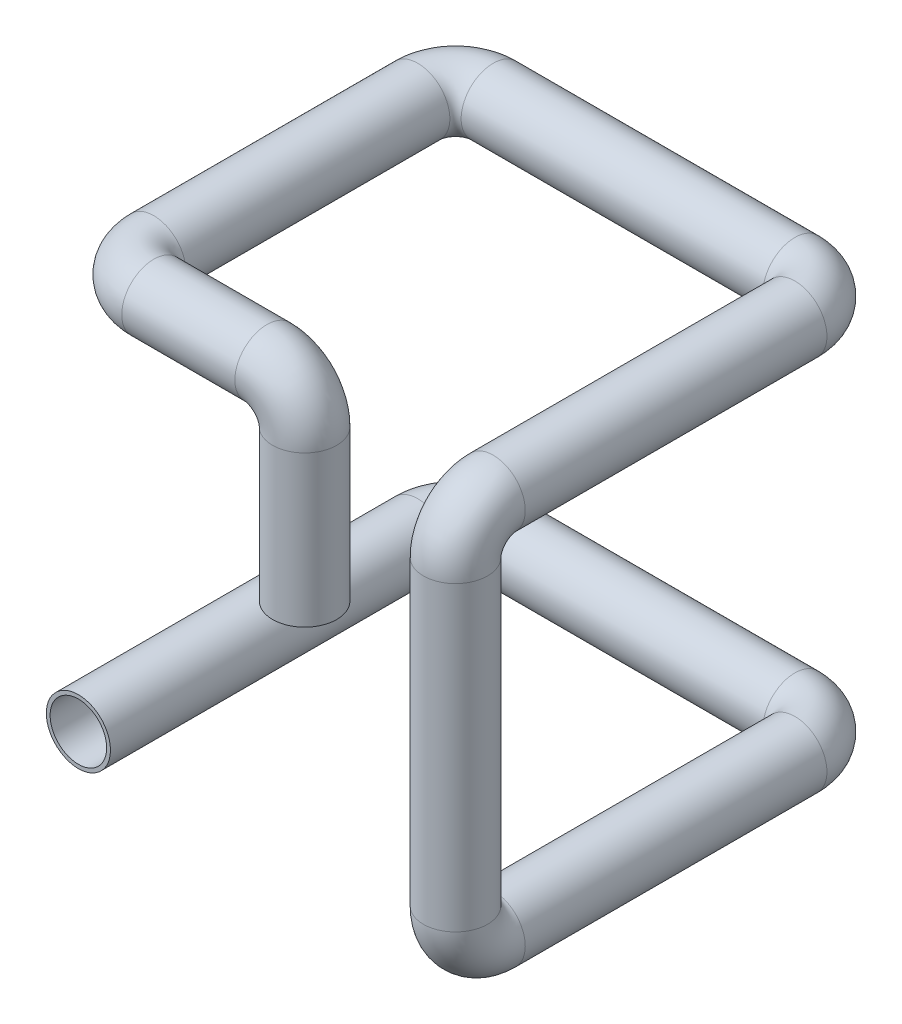
ISO-10303-21;
HEADER;
FILE_DESCRIPTION(('STEP AP214'),'2;1');
FILE_NAME('part.step','',(''),(''),'','','');
FILE_SCHEMA(('AUTOMOTIVE_DESIGN { 1 0 10303 214 1 1 1 1 }'));
ENDSEC;
DATA;
#1=APPLICATION_CONTEXT('core data for automotive mechanical design processes');
#2=APPLICATION_PROTOCOL_DEFINITION('international standard','automotive_design',2000,#1);
#3=PRODUCT_CONTEXT('',#1,'mechanical');
#4=PRODUCT('Part','Part','',(#3));
#5=PRODUCT_RELATED_PRODUCT_CATEGORY('part','',(#4));
#6=PRODUCT_DEFINITION_FORMATION('','',#4);
#7=PRODUCT_DEFINITION_CONTEXT('part definition',#1,'design');
#8=PRODUCT_DEFINITION('design','',#6,#7);
#9=PRODUCT_DEFINITION_SHAPE('','',#8);
#10=(LENGTH_UNIT() NAMED_UNIT(*) SI_UNIT(.MILLI.,.METRE.));
#11=(NAMED_UNIT(*) PLANE_ANGLE_UNIT() SI_UNIT($,.RADIAN.));
#12=(NAMED_UNIT(*) SI_UNIT($,.STERADIAN.) SOLID_ANGLE_UNIT());
#13=UNCERTAINTY_MEASURE_WITH_UNIT(LENGTH_MEASURE(1.E-05),#10,'distance_accuracy_value','');
#14=(GEOMETRIC_REPRESENTATION_CONTEXT(3) GLOBAL_UNCERTAINTY_ASSIGNED_CONTEXT((#13)) GLOBAL_UNIT_ASSIGNED_CONTEXT((#10,
#11,#12)) REPRESENTATION_CONTEXT('',''));
#15=CARTESIAN_POINT('',(0.,0.,0.));
#16=DIRECTION('',(0.,0.,1.));
#17=DIRECTION('',(1.,0.,0.));
#18=AXIS2_PLACEMENT_3D('',#15,#16,#17);
#19=CARTESIAN_POINT('',(0.,0.,0.));
#20=DIRECTION('',(0.,0.,1.));
#21=DIRECTION('',(1.,0.,0.));
#22=AXIS2_PLACEMENT_3D('',#19,#20,#21);
#23=PLANE('',#22);
#24=CARTESIAN_POINT('',(0.,0.,0.));
#25=DIRECTION('',(0.,0.,1.));
#26=DIRECTION('',(1.,0.,0.));
#27=AXIS2_PLACEMENT_3D('',#24,#25,#26);
#28=CIRCLE('',#27,7.5);
#29=CARTESIAN_POINT('',(7.5,0.,0.));
#30=VERTEX_POINT('',#29);
#31=EDGE_CURVE('E567',#30,#30,#28,.T.);
#32=ORIENTED_EDGE('',*,*,#31,.F.);
#33=EDGE_LOOP('',(#32));
#34=FACE_BOUND('',#33,.T.);
#35=CARTESIAN_POINT('',(0.,0.,0.));
#36=DIRECTION('',(0.,0.,1.));
#37=DIRECTION('',(1.,0.,0.));
#38=AXIS2_PLACEMENT_3D('',#35,#36,#37);
#39=CIRCLE('',#38,8.5);
#40=CARTESIAN_POINT('',(8.5,0.,0.));
#41=VERTEX_POINT('',#40);
#42=EDGE_CURVE('E54',#41,#41,#39,.T.);
#43=ORIENTED_EDGE('',*,*,#42,.T.);
#44=EDGE_LOOP('',(#43));
#45=FACE_BOUND('',#44,.T.);
#46=ADVANCED_FACE('F35',(#34,#45),#23,.T.);
#47=CARTESIAN_POINT('',(50.,50.,-10.));
#48=DIRECTION('',(0.,1.,0.));
#49=DIRECTION('',(0.,0.,-1.));
#50=AXIS2_PLACEMENT_3D('',#47,#48,#49);
#51=PLANE('',#50);
#52=CARTESIAN_POINT('',(50.,50.,-10.));
#53=DIRECTION('',(0.,1.,0.));
#54=DIRECTION('',(0.,0.,-1.));
#55=AXIS2_PLACEMENT_3D('',#52,#53,#54);
#56=CIRCLE('',#55,7.5);
#57=CARTESIAN_POINT('',(50.,50.,-17.5));
#58=VERTEX_POINT('',#57);
#59=EDGE_CURVE('E57',#58,#58,#56,.T.);
#60=ORIENTED_EDGE('',*,*,#59,.T.);
#61=EDGE_LOOP('',(#60));
#62=FACE_BOUND('',#61,.T.);
#63=CARTESIAN_POINT('',(50.,50.,-10.));
#64=DIRECTION('',(0.,1.,0.));
#65=DIRECTION('',(0.,0.,1.));
#66=AXIS2_PLACEMENT_3D('',#63,#64,#65);
#67=CIRCLE('',#66,8.5);
#68=CARTESIAN_POINT('',(50.,50.,-1.50000000000001));
#69=VERTEX_POINT('',#68);
#70=EDGE_CURVE('E10',#69,#69,#67,.T.);
#71=ORIENTED_EDGE('',*,*,#70,.F.);
#72=EDGE_LOOP('',(#71));
#73=FACE_BOUND('',#72,.T.);
#74=ADVANCED_FACE('F201',(#62,#73),#51,.F.);
#75=CARTESIAN_POINT('',(0.,0.,0.));
#76=DIRECTION('',(0.,0.,-1.));
#77=DIRECTION('',(-1.,0.,0.));
#78=AXIS2_PLACEMENT_3D('',#75,#76,#77);
#79=CYLINDRICAL_SURFACE('',#78,8.5);
#80=CARTESIAN_POINT('',(0.,0.,-89.9999999999999));
#81=DIRECTION('',(0.,0.,-1.));
#82=DIRECTION('',(-1.,0.,0.));
#83=AXIS2_PLACEMENT_3D('',#80,#81,#82);
#84=CIRCLE('',#83,8.5);
#85=CARTESIAN_POINT('',(-8.5,0.,-89.9999999999999));
#86=VERTEX_POINT('',#85);
#87=EDGE_CURVE('E56',#86,#86,#84,.F.);
#88=ORIENTED_EDGE('',*,*,#87,.T.);
#89=EDGE_LOOP('',(#88));
#90=FACE_BOUND('',#89,.T.);
#91=ORIENTED_EDGE('',*,*,#42,.F.);
#92=EDGE_LOOP('',(#91));
#93=FACE_BOUND('',#92,.T.);
#94=ADVANCED_FACE('F204',(#90,#93),#79,.T.);
#95=CARTESIAN_POINT('',(10.,0.,-90.));
#96=DIRECTION('',(0.,-1.,0.));
#97=DIRECTION('',(0.,0.,-1.));
#98=AXIS2_PLACEMENT_3D('',#95,#96,#97);
#99=TOROIDAL_SURFACE('',#98,10.,8.5);
#100=CARTESIAN_POINT('',(10.,0.,-100.));
#101=DIRECTION('',(-1.,0.,0.));
#102=DIRECTION('',(0.,0.,1.));
#103=AXIS2_PLACEMENT_3D('',#100,#101,#102);
#104=CIRCLE('',#103,8.5);
#105=CARTESIAN_POINT('',(10.,0.,-108.5));
#106=VERTEX_POINT('',#105);
#107=EDGE_CURVE('E61',#106,#106,#104,.T.);
#108=CARTESIAN_POINT('',(10.,0.,-90.));
#109=DIRECTION('',(0.,-1.,0.));
#110=DIRECTION('',(0.,0.,-1.));
#111=AXIS2_PLACEMENT_3D('',#108,#109,#110);
#112=CIRCLE('',#111,18.5);
#113=EDGE_CURVE('',#86,#106,#112,.T.);
#114=ORIENTED_EDGE('',*,*,#87,.F.);
#115=ORIENTED_EDGE('',*,*,#107,.T.);
#116=ORIENTED_EDGE('',*,*,#113,.T.);
#117=ORIENTED_EDGE('',*,*,#113,.F.);
#118=EDGE_LOOP('',(#114,#116,#115,#117));
#119=FACE_BOUND('',#118,.T.);
#120=ADVANCED_FACE('F210',(#119),#99,.T.);
#121=CARTESIAN_POINT('',(10.,0.,-100.));
#122=DIRECTION('',(1.,0.,0.));
#123=DIRECTION('',(0.,0.,-1.));
#124=AXIS2_PLACEMENT_3D('',#121,#122,#123);
#125=CYLINDRICAL_SURFACE('',#124,8.5);
#126=CARTESIAN_POINT('',(90.,0.,-100.));
#127=DIRECTION('',(1.,0.,0.));
#128=DIRECTION('',(0.,0.,-1.));
#129=AXIS2_PLACEMENT_3D('',#126,#127,#128);
#130=CIRCLE('',#129,8.5);
#131=CARTESIAN_POINT('',(90.,0.,-108.5));
#132=VERTEX_POINT('',#131);
#133=EDGE_CURVE('E75',#132,#132,#130,.F.);
#134=ORIENTED_EDGE('',*,*,#133,.T.);
#135=EDGE_LOOP('',(#134));
#136=FACE_BOUND('',#135,.T.);
#137=ORIENTED_EDGE('',*,*,#107,.F.);
#138=EDGE_LOOP('',(#137));
#139=FACE_BOUND('',#138,.T.);
#140=ADVANCED_FACE('F214',(#136,#139),#125,.T.);
#141=CARTESIAN_POINT('',(90.,0.,-90.));
#142=DIRECTION('',(0.,-1.,0.));
#143=DIRECTION('',(0.,0.,-1.));
#144=AXIS2_PLACEMENT_3D('',#141,#142,#143);
#145=TOROIDAL_SURFACE('',#144,9.99999999999999,8.5);
#146=CARTESIAN_POINT('',(100.,0.,-90.));
#147=DIRECTION('',(0.,0.,-1.));
#148=DIRECTION('',(-1.,0.,0.));
#149=AXIS2_PLACEMENT_3D('',#146,#147,#148);
#150=CIRCLE('',#149,8.5);
#151=CARTESIAN_POINT('',(108.5,0.,-90.));
#152=VERTEX_POINT('',#151);
#153=EDGE_CURVE('E78',#152,#152,#150,.T.);
#154=CARTESIAN_POINT('',(90.,0.,-90.));
#155=DIRECTION('',(0.,-1.,0.));
#156=DIRECTION('',(0.,0.,-1.));
#157=AXIS2_PLACEMENT_3D('',#154,#155,#156);
#158=CIRCLE('',#157,18.5);
#159=EDGE_CURVE('',#132,#152,#158,.T.);
#160=ORIENTED_EDGE('',*,*,#133,.F.);
#161=ORIENTED_EDGE('',*,*,#153,.T.);
#162=ORIENTED_EDGE('',*,*,#159,.T.);
#163=ORIENTED_EDGE('',*,*,#159,.F.);
#164=EDGE_LOOP('',(#160,#162,#161,#163));
#165=FACE_BOUND('',#164,.T.);
#166=ADVANCED_FACE('F218',(#165),#145,.T.);
#167=CARTESIAN_POINT('',(100.,0.,-90.));
#168=DIRECTION('',(0.,0.,1.));
#169=DIRECTION('',(1.,0.,0.));
#170=AXIS2_PLACEMENT_3D('',#167,#168,#169);
#171=CYLINDRICAL_SURFACE('',#170,8.5);
#172=CARTESIAN_POINT('',(100.,0.,-10.));
#173=DIRECTION('',(0.,0.,1.));
#174=DIRECTION('',(1.,0.,0.));
#175=AXIS2_PLACEMENT_3D('',#172,#173,#174);
#176=CIRCLE('',#175,8.5);
#177=CARTESIAN_POINT('',(100.,-8.5,-10.));
#178=VERTEX_POINT('',#177);
#179=EDGE_CURVE('E81',#178,#178,#176,.F.);
#180=ORIENTED_EDGE('',*,*,#179,.T.);
#181=EDGE_LOOP('',(#180));
#182=FACE_BOUND('',#181,.T.);
#183=ORIENTED_EDGE('',*,*,#153,.F.);
#184=EDGE_LOOP('',(#183));
#185=FACE_BOUND('',#184,.T.);
#186=ADVANCED_FACE('F222',(#182,#185),#171,.T.);
#187=CARTESIAN_POINT('',(100.,10.,-9.99999999999999));
#188=DIRECTION('',(-1.,0.,0.));
#189=DIRECTION('',(0.,0.,1.));
#190=AXIS2_PLACEMENT_3D('',#187,#188,#189);
#191=TOROIDAL_SURFACE('',#190,10.,8.5);
#192=CARTESIAN_POINT('',(100.,10.,0.));
#193=DIRECTION('',(0.,-1.,0.));
#194=DIRECTION('',(0.,0.,-1.));
#195=AXIS2_PLACEMENT_3D('',#192,#193,#194);
#196=CIRCLE('',#195,8.5);
#197=CARTESIAN_POINT('',(100.,10.,8.50000000000001));
#198=VERTEX_POINT('',#197);
#199=EDGE_CURVE('E84',#198,#198,#196,.T.);
#200=CARTESIAN_POINT('',(100.,10.,-9.99999999999999));
#201=DIRECTION('',(-1.,0.,0.));
#202=DIRECTION('',(0.,0.,1.));
#203=AXIS2_PLACEMENT_3D('',#200,#201,#202);
#204=CIRCLE('',#203,18.5);
#205=EDGE_CURVE('',#178,#198,#204,.T.);
#206=ORIENTED_EDGE('',*,*,#179,.F.);
#207=ORIENTED_EDGE('',*,*,#199,.T.);
#208=ORIENTED_EDGE('',*,*,#205,.T.);
#209=ORIENTED_EDGE('',*,*,#205,.F.);
#210=EDGE_LOOP('',(#206,#208,#207,#209));
#211=FACE_BOUND('',#210,.T.);
#212=ADVANCED_FACE('F226',(#211),#191,.T.);
#213=CARTESIAN_POINT('',(100.,10.,0.));
#214=DIRECTION('',(0.,1.,0.));
#215=DIRECTION('',(0.,0.,1.));
#216=AXIS2_PLACEMENT_3D('',#213,#214,#215);
#217=CYLINDRICAL_SURFACE('',#216,8.5);
#218=CARTESIAN_POINT('',(100.,90.,0.));
#219=DIRECTION('',(0.,1.,0.));
#220=DIRECTION('',(0.,0.,1.));
#221=AXIS2_PLACEMENT_3D('',#218,#219,#220);
#222=CIRCLE('',#221,8.5);
#223=CARTESIAN_POINT('',(100.,90.,8.5));
#224=VERTEX_POINT('',#223);
#225=EDGE_CURVE('E87',#224,#224,#222,.F.);
#226=ORIENTED_EDGE('',*,*,#225,.T.);
#227=EDGE_LOOP('',(#226));
#228=FACE_BOUND('',#227,.T.);
#229=ORIENTED_EDGE('',*,*,#199,.F.);
#230=EDGE_LOOP('',(#229));
#231=FACE_BOUND('',#230,.T.);
#232=ADVANCED_FACE('F230',(#228,#231),#217,.T.);
#233=CARTESIAN_POINT('',(100.,90.,-10.));
#234=DIRECTION('',(-1.,0.,0.));
#235=DIRECTION('',(0.,0.,1.));
#236=AXIS2_PLACEMENT_3D('',#233,#234,#235);
#237=TOROIDAL_SURFACE('',#236,10.,8.5);
#238=CARTESIAN_POINT('',(100.,100.,-10.));
#239=DIRECTION('',(0.,0.,1.));
#240=DIRECTION('',(0.,-1.,0.));
#241=AXIS2_PLACEMENT_3D('',#238,#239,#240);
#242=CIRCLE('',#241,8.5);
#243=CARTESIAN_POINT('',(100.,108.5,-10.));
#244=VERTEX_POINT('',#243);
#245=EDGE_CURVE('E90',#244,#244,#242,.T.);
#246=CARTESIAN_POINT('',(100.,90.,-10.));
#247=DIRECTION('',(-1.,0.,0.));
#248=DIRECTION('',(0.,0.,1.));
#249=AXIS2_PLACEMENT_3D('',#246,#247,#248);
#250=CIRCLE('',#249,18.5);
#251=EDGE_CURVE('',#224,#244,#250,.T.);
#252=ORIENTED_EDGE('',*,*,#225,.F.);
#253=ORIENTED_EDGE('',*,*,#245,.T.);
#254=ORIENTED_EDGE('',*,*,#251,.T.);
#255=ORIENTED_EDGE('',*,*,#251,.F.);
#256=EDGE_LOOP('',(#252,#254,#253,#255));
#257=FACE_BOUND('',#256,.T.);
#258=ADVANCED_FACE('F234',(#257),#237,.T.);
#259=CARTESIAN_POINT('',(100.,100.,-10.));
#260=DIRECTION('',(0.,0.,-1.));
#261=DIRECTION('',(-1.,0.,0.));
#262=AXIS2_PLACEMENT_3D('',#259,#260,#261);
#263=CYLINDRICAL_SURFACE('',#262,8.5);
#264=CARTESIAN_POINT('',(100.,100.,-90.));
#265=DIRECTION('',(0.,0.,-1.));
#266=DIRECTION('',(-1.,0.,0.));
#267=AXIS2_PLACEMENT_3D('',#264,#265,#266);
#268=CIRCLE('',#267,8.5);
#269=CARTESIAN_POINT('',(108.5,100.,-90.));
#270=VERTEX_POINT('',#269);
#271=EDGE_CURVE('E93',#270,#270,#268,.F.);
#272=ORIENTED_EDGE('',*,*,#271,.T.);
#273=EDGE_LOOP('',(#272));
#274=FACE_BOUND('',#273,.T.);
#275=ORIENTED_EDGE('',*,*,#245,.F.);
#276=EDGE_LOOP('',(#275));
#277=FACE_BOUND('',#276,.T.);
#278=ADVANCED_FACE('F238',(#274,#277),#263,.T.);
#279=CARTESIAN_POINT('',(90.,100.,-90.));
#280=DIRECTION('',(0.,1.,0.));
#281=DIRECTION('',(0.,0.,1.));
#282=AXIS2_PLACEMENT_3D('',#279,#280,#281);
#283=TOROIDAL_SURFACE('',#282,9.99999999999999,8.5);
#284=CARTESIAN_POINT('',(90.,100.,-100.));
#285=DIRECTION('',(1.,0.,0.));
#286=DIRECTION('',(0.,0.,-1.));
#287=AXIS2_PLACEMENT_3D('',#284,#285,#286);
#288=CIRCLE('',#287,8.5);
#289=CARTESIAN_POINT('',(90.,100.,-108.5));
#290=VERTEX_POINT('',#289);
#291=EDGE_CURVE('E96',#290,#290,#288,.T.);
#292=CARTESIAN_POINT('',(90.,100.,-90.));
#293=DIRECTION('',(0.,1.,0.));
#294=DIRECTION('',(0.,0.,1.));
#295=AXIS2_PLACEMENT_3D('',#292,#293,#294);
#296=CIRCLE('',#295,18.5);
#297=EDGE_CURVE('',#270,#290,#296,.T.);
#298=ORIENTED_EDGE('',*,*,#271,.F.);
#299=ORIENTED_EDGE('',*,*,#291,.T.);
#300=ORIENTED_EDGE('',*,*,#297,.T.);
#301=ORIENTED_EDGE('',*,*,#297,.F.);
#302=EDGE_LOOP('',(#298,#300,#299,#301));
#303=FACE_BOUND('',#302,.T.);
#304=ADVANCED_FACE('F242',(#303),#283,.T.);
#305=CARTESIAN_POINT('',(90.,100.,-100.));
#306=DIRECTION('',(-1.,0.,0.));
#307=DIRECTION('',(0.,0.,1.));
#308=AXIS2_PLACEMENT_3D('',#305,#306,#307);
#309=CYLINDRICAL_SURFACE('',#308,8.5);
#310=CARTESIAN_POINT('',(10.,100.,-100.));
#311=DIRECTION('',(-1.,0.,0.));
#312=DIRECTION('',(0.,0.,1.));
#313=AXIS2_PLACEMENT_3D('',#310,#311,#312);
#314=CIRCLE('',#313,8.5);
#315=CARTESIAN_POINT('',(10.,100.,-108.5));
#316=VERTEX_POINT('',#315);
#317=EDGE_CURVE('E99',#316,#316,#314,.F.);
#318=ORIENTED_EDGE('',*,*,#317,.T.);
#319=EDGE_LOOP('',(#318));
#320=FACE_BOUND('',#319,.T.);
#321=ORIENTED_EDGE('',*,*,#291,.F.);
#322=EDGE_LOOP('',(#321));
#323=FACE_BOUND('',#322,.T.);
#324=ADVANCED_FACE('F246',(#320,#323),#309,.T.);
#325=CARTESIAN_POINT('',(9.99999999999999,100.,-90.));
#326=DIRECTION('',(0.,1.,0.));
#327=DIRECTION('',(0.,0.,1.));
#328=AXIS2_PLACEMENT_3D('',#325,#326,#327);
#329=TOROIDAL_SURFACE('',#328,9.99999999999999,8.5);
#330=CARTESIAN_POINT('',(0.,100.,-90.));
#331=DIRECTION('',(0.,0.,-1.));
#332=DIRECTION('',(-1.,0.,0.));
#333=AXIS2_PLACEMENT_3D('',#330,#331,#332);
#334=CIRCLE('',#333,8.5);
#335=CARTESIAN_POINT('',(-8.5,100.,-90.));
#336=VERTEX_POINT('',#335);
#337=EDGE_CURVE('E102',#336,#336,#334,.T.);
#338=CARTESIAN_POINT('',(9.99999999999999,100.,-90.));
#339=DIRECTION('',(0.,1.,0.));
#340=DIRECTION('',(0.,0.,1.));
#341=AXIS2_PLACEMENT_3D('',#338,#339,#340);
#342=CIRCLE('',#341,18.5);
#343=EDGE_CURVE('',#316,#336,#342,.T.);
#344=ORIENTED_EDGE('',*,*,#317,.F.);
#345=ORIENTED_EDGE('',*,*,#337,.T.);
#346=ORIENTED_EDGE('',*,*,#343,.T.);
#347=ORIENTED_EDGE('',*,*,#343,.F.);
#348=EDGE_LOOP('',(#344,#346,#345,#347));
#349=FACE_BOUND('',#348,.T.);
#350=ADVANCED_FACE('F250',(#349),#329,.T.);
#351=CARTESIAN_POINT('',(0.,100.,-90.));
#352=DIRECTION('',(0.,0.,1.));
#353=DIRECTION('',(1.,0.,0.));
#354=AXIS2_PLACEMENT_3D('',#351,#352,#353);
#355=CYLINDRICAL_SURFACE('',#354,8.5);
#356=CARTESIAN_POINT('',(0.,100.,-20.));
#357=DIRECTION('',(0.,0.,1.));
#358=DIRECTION('',(1.,0.,0.));
#359=AXIS2_PLACEMENT_3D('',#356,#357,#358);
#360=CIRCLE('',#359,8.5);
#361=CARTESIAN_POINT('',(-8.5,100.,-20.));
#362=VERTEX_POINT('',#361);
#363=EDGE_CURVE('E105',#362,#362,#360,.F.);
#364=ORIENTED_EDGE('',*,*,#363,.T.);
#365=EDGE_LOOP('',(#364));
#366=FACE_BOUND('',#365,.T.);
#367=ORIENTED_EDGE('',*,*,#337,.F.);
#368=EDGE_LOOP('',(#367));
#369=FACE_BOUND('',#368,.T.);
#370=ADVANCED_FACE('F122',(#366,#369),#355,.T.);
#371=CARTESIAN_POINT('',(10.,100.,-20.));
#372=DIRECTION('',(0.,1.,0.));
#373=DIRECTION('',(0.,0.,1.));
#374=AXIS2_PLACEMENT_3D('',#371,#372,#373);
#375=TOROIDAL_SURFACE('',#374,10.,8.5);
#376=CARTESIAN_POINT('',(10.,100.,-10.));
#377=DIRECTION('',(-1.,0.,0.));
#378=DIRECTION('',(0.,0.,1.));
#379=AXIS2_PLACEMENT_3D('',#376,#377,#378);
#380=CIRCLE('',#379,8.5);
#381=CARTESIAN_POINT('',(10.,100.,-1.50000000000002));
#382=VERTEX_POINT('',#381);
#383=EDGE_CURVE('E51',#382,#382,#380,.T.);
#384=CARTESIAN_POINT('',(10.,100.,-20.));
#385=DIRECTION('',(0.,1.,0.));
#386=DIRECTION('',(0.,0.,1.));
#387=AXIS2_PLACEMENT_3D('',#384,#385,#386);
#388=CIRCLE('',#387,18.5);
#389=EDGE_CURVE('',#362,#382,#388,.T.);
#390=ORIENTED_EDGE('',*,*,#363,.F.);
#391=ORIENTED_EDGE('',*,*,#383,.T.);
#392=ORIENTED_EDGE('',*,*,#389,.T.);
#393=ORIENTED_EDGE('',*,*,#389,.F.);
#394=EDGE_LOOP('',(#390,#392,#391,#393));
#395=FACE_BOUND('',#394,.T.);
#396=ADVANCED_FACE('F110',(#395),#375,.T.);
#397=CARTESIAN_POINT('',(10.,100.,-10.));
#398=DIRECTION('',(1.,0.,0.));
#399=DIRECTION('',(0.,0.,-1.));
#400=AXIS2_PLACEMENT_3D('',#397,#398,#399);
#401=CYLINDRICAL_SURFACE('',#400,8.5);
#402=CARTESIAN_POINT('',(40.,100.,-10.));
#403=DIRECTION('',(1.,0.,0.));
#404=DIRECTION('',(0.,0.,-1.));
#405=AXIS2_PLACEMENT_3D('',#402,#403,#404);
#406=CIRCLE('',#405,8.5);
#407=CARTESIAN_POINT('',(40.,108.5,-10.));
#408=VERTEX_POINT('',#407);
#409=EDGE_CURVE('E46',#408,#408,#406,.F.);
#410=ORIENTED_EDGE('',*,*,#409,.T.);
#411=EDGE_LOOP('',(#410));
#412=FACE_BOUND('',#411,.T.);
#413=ORIENTED_EDGE('',*,*,#383,.F.);
#414=EDGE_LOOP('',(#413));
#415=FACE_BOUND('',#414,.T.);
#416=ADVANCED_FACE('F113',(#412,#415),#401,.T.);
#417=CARTESIAN_POINT('',(40.,90.,-10.));
#418=DIRECTION('',(0.,0.,-1.));
#419=DIRECTION('',(-1.,0.,0.));
#420=AXIS2_PLACEMENT_3D('',#417,#418,#419);
#421=TOROIDAL_SURFACE('',#420,9.99999999999999,8.5);
#422=CARTESIAN_POINT('',(50.,90.,-10.));
#423=DIRECTION('',(0.,1.,0.));
#424=DIRECTION('',(-1.,0.,0.));
#425=AXIS2_PLACEMENT_3D('',#422,#423,#424);
#426=CIRCLE('',#425,8.5);
#427=CARTESIAN_POINT('',(58.5,90.,-10.));
#428=VERTEX_POINT('',#427);
#429=EDGE_CURVE('E42',#428,#428,#426,.T.);
#430=CARTESIAN_POINT('',(40.,90.,-10.));
#431=DIRECTION('',(0.,0.,-1.));
#432=DIRECTION('',(-1.,0.,0.));
#433=AXIS2_PLACEMENT_3D('',#430,#431,#432);
#434=CIRCLE('',#433,18.5);
#435=EDGE_CURVE('',#408,#428,#434,.T.);
#436=ORIENTED_EDGE('',*,*,#409,.F.);
#437=ORIENTED_EDGE('',*,*,#429,.T.);
#438=ORIENTED_EDGE('',*,*,#435,.T.);
#439=ORIENTED_EDGE('',*,*,#435,.F.);
#440=EDGE_LOOP('',(#436,#438,#437,#439));
#441=FACE_BOUND('',#440,.T.);
#442=ADVANCED_FACE('F115',(#441),#421,.T.);
#443=CARTESIAN_POINT('',(50.,90.,-10.));
#444=DIRECTION('',(0.,-1.,0.));
#445=DIRECTION('',(0.,0.,-1.));
#446=AXIS2_PLACEMENT_3D('',#443,#444,#445);
#447=CYLINDRICAL_SURFACE('',#446,8.5);
#448=ORIENTED_EDGE('',*,*,#70,.T.);
#449=EDGE_LOOP('',(#448));
#450=FACE_BOUND('',#449,.T.);
#451=ORIENTED_EDGE('',*,*,#429,.F.);
#452=EDGE_LOOP('',(#451));
#453=FACE_BOUND('',#452,.T.);
#454=ADVANCED_FACE('F37',(#450,#453),#447,.T.);
#455=CARTESIAN_POINT('',(0.,0.,0.));
#456=DIRECTION('',(0.,0.,-1.));
#457=DIRECTION('',(-1.,0.,0.));
#458=AXIS2_PLACEMENT_3D('',#455,#456,#457);
#459=CYLINDRICAL_SURFACE('',#458,7.5);
#460=CARTESIAN_POINT('',(0.,0.,-90.));
#461=DIRECTION('',(0.,0.,1.));
#462=DIRECTION('',(1.,0.,0.));
#463=AXIS2_PLACEMENT_3D('',#460,#461,#462);
#464=CIRCLE('',#463,7.5);
#465=CARTESIAN_POINT('',(-7.5,0.,-89.9999999999999));
#466=VERTEX_POINT('',#465);
#467=EDGE_CURVE('E568',#466,#466,#464,.T.);
#468=ORIENTED_EDGE('',*,*,#467,.F.);
#469=EDGE_LOOP('',(#468));
#470=FACE_BOUND('',#469,.T.);
#471=ORIENTED_EDGE('',*,*,#31,.T.);
#472=EDGE_LOOP('',(#471));
#473=FACE_BOUND('',#472,.T.);
#474=ADVANCED_FACE('F125',(#470,#473),#459,.F.);
#475=CARTESIAN_POINT('',(10.,0.,-90.));
#476=DIRECTION('',(0.,-1.,0.));
#477=DIRECTION('',(0.,0.,-1.));
#478=AXIS2_PLACEMENT_3D('',#475,#476,#477);
#479=TOROIDAL_SURFACE('',#478,10.,7.5);
#480=CARTESIAN_POINT('',(10.,0.,-100.));
#481=DIRECTION('',(-1.,0.,0.));
#482=DIRECTION('',(0.,0.,1.));
#483=AXIS2_PLACEMENT_3D('',#480,#481,#482);
#484=CIRCLE('',#483,7.5);
#485=CARTESIAN_POINT('',(10.,0.,-107.5));
#486=VERTEX_POINT('',#485);
#487=EDGE_CURVE('E571',#486,#486,#484,.T.);
#488=CARTESIAN_POINT('',(10.,0.,-90.));
#489=DIRECTION('',(0.,-1.,0.));
#490=DIRECTION('',(0.,0.,-1.));
#491=AXIS2_PLACEMENT_3D('',#488,#489,#490);
#492=CIRCLE('',#491,17.5);
#493=EDGE_CURVE('',#466,#486,#492,.T.);
#494=ORIENTED_EDGE('',*,*,#467,.T.);
#495=ORIENTED_EDGE('',*,*,#487,.F.);
#496=ORIENTED_EDGE('',*,*,#493,.T.);
#497=ORIENTED_EDGE('',*,*,#493,.F.);
#498=EDGE_LOOP('',(#494,#496,#495,#497));
#499=FACE_BOUND('',#498,.T.);
#500=ADVANCED_FACE('F129',(#499),#479,.F.);
#501=CARTESIAN_POINT('',(10.,0.,-100.));
#502=DIRECTION('',(1.,0.,0.));
#503=DIRECTION('',(0.,0.,-1.));
#504=AXIS2_PLACEMENT_3D('',#501,#502,#503);
#505=CYLINDRICAL_SURFACE('',#504,7.5);
#506=CARTESIAN_POINT('',(90.,0.,-100.));
#507=DIRECTION('',(-1.,0.,0.));
#508=DIRECTION('',(0.,0.,1.));
#509=AXIS2_PLACEMENT_3D('',#506,#507,#508);
#510=CIRCLE('',#509,7.5);
#511=CARTESIAN_POINT('',(90.,0.,-107.5));
#512=VERTEX_POINT('',#511);
#513=EDGE_CURVE('E576',#512,#512,#510,.T.);
#514=ORIENTED_EDGE('',*,*,#513,.F.);
#515=EDGE_LOOP('',(#514));
#516=FACE_BOUND('',#515,.T.);
#517=ORIENTED_EDGE('',*,*,#487,.T.);
#518=EDGE_LOOP('',(#517));
#519=FACE_BOUND('',#518,.T.);
#520=ADVANCED_FACE('F136',(#516,#519),#505,.F.);
#521=CARTESIAN_POINT('',(90.,0.,-90.));
#522=DIRECTION('',(0.,-1.,0.));
#523=DIRECTION('',(0.,0.,-1.));
#524=AXIS2_PLACEMENT_3D('',#521,#522,#523);
#525=TOROIDAL_SURFACE('',#524,9.99999999999999,7.5);
#526=CARTESIAN_POINT('',(100.,0.,-90.));
#527=DIRECTION('',(0.,0.,-1.));
#528=DIRECTION('',(-1.,0.,0.));
#529=AXIS2_PLACEMENT_3D('',#526,#527,#528);
#530=CIRCLE('',#529,7.5);
#531=CARTESIAN_POINT('',(107.5,0.,-90.));
#532=VERTEX_POINT('',#531);
#533=EDGE_CURVE('E579',#532,#532,#530,.T.);
#534=CARTESIAN_POINT('',(90.,0.,-90.));
#535=DIRECTION('',(0.,-1.,0.));
#536=DIRECTION('',(0.,0.,-1.));
#537=AXIS2_PLACEMENT_3D('',#534,#535,#536);
#538=CIRCLE('',#537,17.5);
#539=EDGE_CURVE('',#512,#532,#538,.T.);
#540=ORIENTED_EDGE('',*,*,#513,.T.);
#541=ORIENTED_EDGE('',*,*,#533,.F.);
#542=ORIENTED_EDGE('',*,*,#539,.T.);
#543=ORIENTED_EDGE('',*,*,#539,.F.);
#544=EDGE_LOOP('',(#540,#542,#541,#543));
#545=FACE_BOUND('',#544,.T.);
#546=ADVANCED_FACE('F144',(#545),#525,.F.);
#547=CARTESIAN_POINT('',(100.,0.,-90.));
#548=DIRECTION('',(0.,0.,1.));
#549=DIRECTION('',(1.,0.,0.));
#550=AXIS2_PLACEMENT_3D('',#547,#548,#549);
#551=CYLINDRICAL_SURFACE('',#550,7.5);
#552=CARTESIAN_POINT('',(100.,0.,-10.));
#553=DIRECTION('',(0.,0.,-1.));
#554=DIRECTION('',(-1.,0.,0.));
#555=AXIS2_PLACEMENT_3D('',#552,#553,#554);
#556=CIRCLE('',#555,7.5);
#557=CARTESIAN_POINT('',(100.,-7.5,-10.));
#558=VERTEX_POINT('',#557);
#559=EDGE_CURVE('E582',#558,#558,#556,.T.);
#560=ORIENTED_EDGE('',*,*,#559,.F.);
#561=EDGE_LOOP('',(#560));
#562=FACE_BOUND('',#561,.T.);
#563=ORIENTED_EDGE('',*,*,#533,.T.);
#564=EDGE_LOOP('',(#563));
#565=FACE_BOUND('',#564,.T.);
#566=ADVANCED_FACE('F148',(#562,#565),#551,.F.);
#567=CARTESIAN_POINT('',(100.,10.,-9.99999999999999));
#568=DIRECTION('',(-1.,0.,0.));
#569=DIRECTION('',(0.,0.,1.));
#570=AXIS2_PLACEMENT_3D('',#567,#568,#569);
#571=TOROIDAL_SURFACE('',#570,10.,7.5);
#572=CARTESIAN_POINT('',(100.,10.,0.));
#573=DIRECTION('',(0.,-1.,0.));
#574=DIRECTION('',(-1.,0.,0.));
#575=AXIS2_PLACEMENT_3D('',#572,#573,#574);
#576=CIRCLE('',#575,7.5);
#577=CARTESIAN_POINT('',(100.,10.,7.50000000000001));
#578=VERTEX_POINT('',#577);
#579=EDGE_CURVE('E585',#578,#578,#576,.T.);
#580=CARTESIAN_POINT('',(100.,10.,-9.99999999999999));
#581=DIRECTION('',(-1.,0.,0.));
#582=DIRECTION('',(0.,0.,1.));
#583=AXIS2_PLACEMENT_3D('',#580,#581,#582);
#584=CIRCLE('',#583,17.5);
#585=EDGE_CURVE('',#558,#578,#584,.T.);
#586=ORIENTED_EDGE('',*,*,#559,.T.);
#587=ORIENTED_EDGE('',*,*,#579,.F.);
#588=ORIENTED_EDGE('',*,*,#585,.T.);
#589=ORIENTED_EDGE('',*,*,#585,.F.);
#590=EDGE_LOOP('',(#586,#588,#587,#589));
#591=FACE_BOUND('',#590,.T.);
#592=ADVANCED_FACE('F152',(#591),#571,.F.);
#593=CARTESIAN_POINT('',(100.,10.,0.));
#594=DIRECTION('',(0.,1.,0.));
#595=DIRECTION('',(0.,0.,1.));
#596=AXIS2_PLACEMENT_3D('',#593,#594,#595);
#597=CYLINDRICAL_SURFACE('',#596,7.5);
#598=CARTESIAN_POINT('',(100.,90.,0.));
#599=DIRECTION('',(0.,-1.,0.));
#600=DIRECTION('',(-1.,0.,0.));
#601=AXIS2_PLACEMENT_3D('',#598,#599,#600);
#602=CIRCLE('',#601,7.5);
#603=CARTESIAN_POINT('',(100.,90.,7.5));
#604=VERTEX_POINT('',#603);
#605=EDGE_CURVE('E588',#604,#604,#602,.T.);
#606=ORIENTED_EDGE('',*,*,#605,.F.);
#607=EDGE_LOOP('',(#606));
#608=FACE_BOUND('',#607,.T.);
#609=ORIENTED_EDGE('',*,*,#579,.T.);
#610=EDGE_LOOP('',(#609));
#611=FACE_BOUND('',#610,.T.);
#612=ADVANCED_FACE('F156',(#608,#611),#597,.F.);
#613=CARTESIAN_POINT('',(100.,90.,-10.));
#614=DIRECTION('',(-1.,0.,0.));
#615=DIRECTION('',(0.,0.,1.));
#616=AXIS2_PLACEMENT_3D('',#613,#614,#615);
#617=TOROIDAL_SURFACE('',#616,10.,7.5);
#618=CARTESIAN_POINT('',(100.,100.,-10.));
#619=DIRECTION('',(0.,0.,1.));
#620=DIRECTION('',(-1.,0.,0.));
#621=AXIS2_PLACEMENT_3D('',#618,#619,#620);
#622=CIRCLE('',#621,7.5);
#623=CARTESIAN_POINT('',(100.,107.5,-10.));
#624=VERTEX_POINT('',#623);
#625=EDGE_CURVE('E591',#624,#624,#622,.T.);
#626=CARTESIAN_POINT('',(100.,90.,-10.));
#627=DIRECTION('',(-1.,0.,0.));
#628=DIRECTION('',(0.,0.,1.));
#629=AXIS2_PLACEMENT_3D('',#626,#627,#628);
#630=CIRCLE('',#629,17.5);
#631=EDGE_CURVE('',#604,#624,#630,.T.);
#632=ORIENTED_EDGE('',*,*,#605,.T.);
#633=ORIENTED_EDGE('',*,*,#625,.F.);
#634=ORIENTED_EDGE('',*,*,#631,.T.);
#635=ORIENTED_EDGE('',*,*,#631,.F.);
#636=EDGE_LOOP('',(#632,#634,#633,#635));
#637=FACE_BOUND('',#636,.T.);
#638=ADVANCED_FACE('F160',(#637),#617,.F.);
#639=CARTESIAN_POINT('',(100.,100.,-10.));
#640=DIRECTION('',(0.,0.,-1.));
#641=DIRECTION('',(-1.,0.,0.));
#642=AXIS2_PLACEMENT_3D('',#639,#640,#641);
#643=CYLINDRICAL_SURFACE('',#642,7.5);
#644=CARTESIAN_POINT('',(100.,100.,-90.));
#645=DIRECTION('',(0.,0.,1.));
#646=DIRECTION('',(-1.,0.,0.));
#647=AXIS2_PLACEMENT_3D('',#644,#645,#646);
#648=CIRCLE('',#647,7.5);
#649=CARTESIAN_POINT('',(107.5,100.,-90.));
#650=VERTEX_POINT('',#649);
#651=EDGE_CURVE('E594',#650,#650,#648,.T.);
#652=ORIENTED_EDGE('',*,*,#651,.F.);
#653=EDGE_LOOP('',(#652));
#654=FACE_BOUND('',#653,.T.);
#655=ORIENTED_EDGE('',*,*,#625,.T.);
#656=EDGE_LOOP('',(#655));
#657=FACE_BOUND('',#656,.T.);
#658=ADVANCED_FACE('F164',(#654,#657),#643,.F.);
#659=CARTESIAN_POINT('',(90.,100.,-90.));
#660=DIRECTION('',(0.,1.,0.));
#661=DIRECTION('',(0.,0.,1.));
#662=AXIS2_PLACEMENT_3D('',#659,#660,#661);
#663=TOROIDAL_SURFACE('',#662,9.99999999999999,7.5);
#664=CARTESIAN_POINT('',(90.,100.,-100.));
#665=DIRECTION('',(1.,0.,0.));
#666=DIRECTION('',(0.,0.,1.));
#667=AXIS2_PLACEMENT_3D('',#664,#665,#666);
#668=CIRCLE('',#667,7.5);
#669=CARTESIAN_POINT('',(90.,100.,-107.5));
#670=VERTEX_POINT('',#669);
#671=EDGE_CURVE('E597',#670,#670,#668,.T.);
#672=CARTESIAN_POINT('',(90.,100.,-90.));
#673=DIRECTION('',(0.,1.,0.));
#674=DIRECTION('',(0.,0.,1.));
#675=AXIS2_PLACEMENT_3D('',#672,#673,#674);
#676=CIRCLE('',#675,17.5);
#677=EDGE_CURVE('',#650,#670,#676,.T.);
#678=ORIENTED_EDGE('',*,*,#651,.T.);
#679=ORIENTED_EDGE('',*,*,#671,.F.);
#680=ORIENTED_EDGE('',*,*,#677,.T.);
#681=ORIENTED_EDGE('',*,*,#677,.F.);
#682=EDGE_LOOP('',(#678,#680,#679,#681));
#683=FACE_BOUND('',#682,.T.);
#684=ADVANCED_FACE('F168',(#683),#663,.F.);
#685=CARTESIAN_POINT('',(90.,100.,-100.));
#686=DIRECTION('',(-1.,0.,0.));
#687=DIRECTION('',(0.,0.,1.));
#688=AXIS2_PLACEMENT_3D('',#685,#686,#687);
#689=CYLINDRICAL_SURFACE('',#688,7.5);
#690=CARTESIAN_POINT('',(10.,100.,-100.));
#691=DIRECTION('',(1.,0.,0.));
#692=DIRECTION('',(0.,0.,1.));
#693=AXIS2_PLACEMENT_3D('',#690,#691,#692);
#694=CIRCLE('',#693,7.5);
#695=CARTESIAN_POINT('',(10.,100.,-107.5));
#696=VERTEX_POINT('',#695);
#697=EDGE_CURVE('E600',#696,#696,#694,.T.);
#698=ORIENTED_EDGE('',*,*,#697,.F.);
#699=EDGE_LOOP('',(#698));
#700=FACE_BOUND('',#699,.T.);
#701=ORIENTED_EDGE('',*,*,#671,.T.);
#702=EDGE_LOOP('',(#701));
#703=FACE_BOUND('',#702,.T.);
#704=ADVANCED_FACE('F172',(#700,#703),#689,.F.);
#705=CARTESIAN_POINT('',(9.99999999999999,100.,-90.));
#706=DIRECTION('',(0.,1.,0.));
#707=DIRECTION('',(0.,0.,1.));
#708=AXIS2_PLACEMENT_3D('',#705,#706,#707);
#709=TOROIDAL_SURFACE('',#708,9.99999999999999,7.5);
#710=CARTESIAN_POINT('',(0.,100.,-90.));
#711=DIRECTION('',(0.,0.,-1.));
#712=DIRECTION('',(1.,0.,0.));
#713=AXIS2_PLACEMENT_3D('',#710,#711,#712);
#714=CIRCLE('',#713,7.5);
#715=CARTESIAN_POINT('',(-7.5,100.,-90.));
#716=VERTEX_POINT('',#715);
#717=EDGE_CURVE('E603',#716,#716,#714,.T.);
#718=CARTESIAN_POINT('',(9.99999999999999,100.,-90.));
#719=DIRECTION('',(0.,1.,0.));
#720=DIRECTION('',(0.,0.,1.));
#721=AXIS2_PLACEMENT_3D('',#718,#719,#720);
#722=CIRCLE('',#721,17.5);
#723=EDGE_CURVE('',#696,#716,#722,.T.);
#724=ORIENTED_EDGE('',*,*,#697,.T.);
#725=ORIENTED_EDGE('',*,*,#717,.F.);
#726=ORIENTED_EDGE('',*,*,#723,.T.);
#727=ORIENTED_EDGE('',*,*,#723,.F.);
#728=EDGE_LOOP('',(#724,#726,#725,#727));
#729=FACE_BOUND('',#728,.T.);
#730=ADVANCED_FACE('F176',(#729),#709,.F.);
#731=CARTESIAN_POINT('',(0.,100.,-90.));
#732=DIRECTION('',(0.,0.,1.));
#733=DIRECTION('',(1.,0.,0.));
#734=AXIS2_PLACEMENT_3D('',#731,#732,#733);
#735=CYLINDRICAL_SURFACE('',#734,7.5);
#736=CARTESIAN_POINT('',(0.,100.,-20.));
#737=DIRECTION('',(0.,0.,-1.));
#738=DIRECTION('',(1.,0.,0.));
#739=AXIS2_PLACEMENT_3D('',#736,#737,#738);
#740=CIRCLE('',#739,7.5);
#741=CARTESIAN_POINT('',(-7.5,100.,-20.));
#742=VERTEX_POINT('',#741);
#743=EDGE_CURVE('E606',#742,#742,#740,.T.);
#744=ORIENTED_EDGE('',*,*,#743,.F.);
#745=EDGE_LOOP('',(#744));
#746=FACE_BOUND('',#745,.T.);
#747=ORIENTED_EDGE('',*,*,#717,.T.);
#748=EDGE_LOOP('',(#747));
#749=FACE_BOUND('',#748,.T.);
#750=ADVANCED_FACE('F180',(#746,#749),#735,.F.);
#751=CARTESIAN_POINT('',(10.,100.,-20.));
#752=DIRECTION('',(0.,1.,0.));
#753=DIRECTION('',(0.,0.,1.));
#754=AXIS2_PLACEMENT_3D('',#751,#752,#753);
#755=TOROIDAL_SURFACE('',#754,10.,7.5);
#756=CARTESIAN_POINT('',(10.,100.,-10.));
#757=DIRECTION('',(-1.,0.,0.));
#758=DIRECTION('',(0.,0.,-1.));
#759=AXIS2_PLACEMENT_3D('',#756,#757,#758);
#760=CIRCLE('',#759,7.5);
#761=CARTESIAN_POINT('',(10.,100.,-2.50000000000002));
#762=VERTEX_POINT('',#761);
#763=EDGE_CURVE('E609',#762,#762,#760,.T.);
#764=CARTESIAN_POINT('',(10.,100.,-20.));
#765=DIRECTION('',(0.,1.,0.));
#766=DIRECTION('',(0.,0.,1.));
#767=AXIS2_PLACEMENT_3D('',#764,#765,#766);
#768=CIRCLE('',#767,17.5);
#769=EDGE_CURVE('',#742,#762,#768,.T.);
#770=ORIENTED_EDGE('',*,*,#743,.T.);
#771=ORIENTED_EDGE('',*,*,#763,.F.);
#772=ORIENTED_EDGE('',*,*,#769,.T.);
#773=ORIENTED_EDGE('',*,*,#769,.F.);
#774=EDGE_LOOP('',(#770,#772,#771,#773));
#775=FACE_BOUND('',#774,.T.);
#776=ADVANCED_FACE('F184',(#775),#755,.F.);
#777=CARTESIAN_POINT('',(10.,100.,-10.));
#778=DIRECTION('',(1.,0.,0.));
#779=DIRECTION('',(0.,0.,-1.));
#780=AXIS2_PLACEMENT_3D('',#777,#778,#779);
#781=CYLINDRICAL_SURFACE('',#780,7.5);
#782=CARTESIAN_POINT('',(40.,100.,-10.));
#783=DIRECTION('',(-1.,0.,0.));
#784=DIRECTION('',(0.,0.,-1.));
#785=AXIS2_PLACEMENT_3D('',#782,#783,#784);
#786=CIRCLE('',#785,7.5);
#787=CARTESIAN_POINT('',(40.,107.5,-10.));
#788=VERTEX_POINT('',#787);
#789=EDGE_CURVE('E69',#788,#788,#786,.T.);
#790=ORIENTED_EDGE('',*,*,#789,.F.);
#791=EDGE_LOOP('',(#790));
#792=FACE_BOUND('',#791,.T.);
#793=ORIENTED_EDGE('',*,*,#763,.T.);
#794=EDGE_LOOP('',(#793));
#795=FACE_BOUND('',#794,.T.);
#796=ADVANCED_FACE('F188',(#792,#795),#781,.F.);
#797=CARTESIAN_POINT('',(40.,90.,-10.));
#798=DIRECTION('',(0.,0.,-1.));
#799=DIRECTION('',(-1.,0.,0.));
#800=AXIS2_PLACEMENT_3D('',#797,#798,#799);
#801=TOROIDAL_SURFACE('',#800,9.99999999999999,7.5);
#802=CARTESIAN_POINT('',(50.,90.,-10.));
#803=DIRECTION('',(0.,1.,0.));
#804=DIRECTION('',(0.,0.,-1.));
#805=AXIS2_PLACEMENT_3D('',#802,#803,#804);
#806=CIRCLE('',#805,7.5);
#807=CARTESIAN_POINT('',(57.5,90.,-10.));
#808=VERTEX_POINT('',#807);
#809=EDGE_CURVE('E64',#808,#808,#806,.T.);
#810=CARTESIAN_POINT('',(40.,90.,-10.));
#811=DIRECTION('',(0.,0.,-1.));
#812=DIRECTION('',(-1.,0.,0.));
#813=AXIS2_PLACEMENT_3D('',#810,#811,#812);
#814=CIRCLE('',#813,17.5);
#815=EDGE_CURVE('',#788,#808,#814,.T.);
#816=ORIENTED_EDGE('',*,*,#789,.T.);
#817=ORIENTED_EDGE('',*,*,#809,.F.);
#818=ORIENTED_EDGE('',*,*,#815,.T.);
#819=ORIENTED_EDGE('',*,*,#815,.F.);
#820=EDGE_LOOP('',(#816,#818,#817,#819));
#821=FACE_BOUND('',#820,.T.);
#822=ADVANCED_FACE('F192',(#821),#801,.F.);
#823=CARTESIAN_POINT('',(50.,90.,-10.));
#824=DIRECTION('',(0.,-1.,0.));
#825=DIRECTION('',(0.,0.,-1.));
#826=AXIS2_PLACEMENT_3D('',#823,#824,#825);
#827=CYLINDRICAL_SURFACE('',#826,7.5);
#828=ORIENTED_EDGE('',*,*,#59,.F.);
#829=EDGE_LOOP('',(#828));
#830=FACE_BOUND('',#829,.T.);
#831=ORIENTED_EDGE('',*,*,#809,.T.);
#832=EDGE_LOOP('',(#831));
#833=FACE_BOUND('',#832,.T.);
#834=ADVANCED_FACE('F196',(#830,#833),#827,.F.);
#835=CLOSED_SHELL('',(#46,#74,#94,#120,#140,#166,#186,#212,#232,#258,#278,#304,#324,#350,#370,
#396,#416,#442,#454,#474,#500,#520,#546,#566,#592,#612,#638,#658,#684,#704,#730,#750,#776,#796,
#822,#834));
#836=MANIFOLD_SOLID_BREP('B2',#835);
#837=ADVANCED_BREP_SHAPE_REPRESENTATION('',(#18,#836),#14);
#838=SHAPE_DEFINITION_REPRESENTATION(#9,#837);
ENDSEC;
END-ISO-10303-21;
